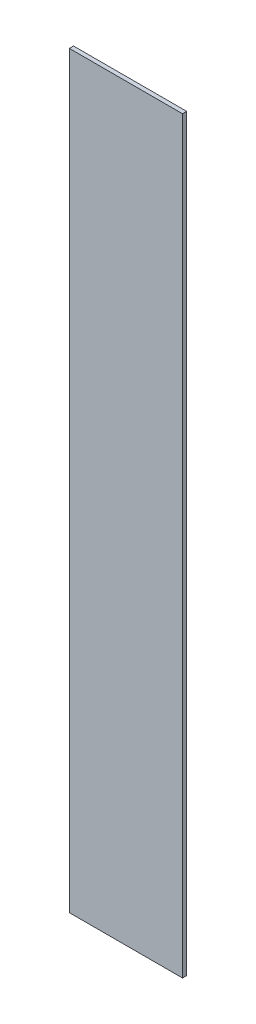
ISO-10303-21;
HEADER;
FILE_DESCRIPTION(('STEP AP214'),'2;1');
FILE_NAME('part.step','',(''),(''),'','','');
FILE_SCHEMA(('AUTOMOTIVE_DESIGN { 1 0 10303 214 1 1 1 1 }'));
ENDSEC;
DATA;
#1=APPLICATION_CONTEXT('core data for automotive mechanical design processes');
#2=APPLICATION_PROTOCOL_DEFINITION('international standard','automotive_design',2000,#1);
#3=PRODUCT_CONTEXT('',#1,'mechanical');
#4=PRODUCT('Part','Part','',(#3));
#5=PRODUCT_RELATED_PRODUCT_CATEGORY('part','',(#4));
#6=PRODUCT_DEFINITION_FORMATION('','',#4);
#7=PRODUCT_DEFINITION_CONTEXT('part definition',#1,'design');
#8=PRODUCT_DEFINITION('design','',#6,#7);
#9=PRODUCT_DEFINITION_SHAPE('','',#8);
#10=(LENGTH_UNIT() NAMED_UNIT(*) SI_UNIT(.MILLI.,.METRE.));
#11=(NAMED_UNIT(*) PLANE_ANGLE_UNIT() SI_UNIT($,.RADIAN.));
#12=(NAMED_UNIT(*) SI_UNIT($,.STERADIAN.) SOLID_ANGLE_UNIT());
#13=UNCERTAINTY_MEASURE_WITH_UNIT(LENGTH_MEASURE(1.E-05),#10,'distance_accuracy_value','');
#14=(GEOMETRIC_REPRESENTATION_CONTEXT(3) GLOBAL_UNCERTAINTY_ASSIGNED_CONTEXT((#13)) GLOBAL_UNIT_ASSIGNED_CONTEXT((#10,
#11,#12)) REPRESENTATION_CONTEXT('',''));
#15=CARTESIAN_POINT('',(0.,0.,0.));
#16=DIRECTION('',(0.,0.,1.));
#17=DIRECTION('',(1.,0.,0.));
#18=AXIS2_PLACEMENT_3D('',#15,#16,#17);
#19=CARTESIAN_POINT('',(0.,0.,3.175));
#20=DIRECTION('',(1.,0.,0.));
#21=DIRECTION('',(0.,0.,-1.));
#22=AXIS2_PLACEMENT_3D('',#19,#20,#21);
#23=PLANE('',#22);
#24=DIRECTION('',(0.,-1.,0.));
#25=VECTOR('',#24,1.);
#26=CARTESIAN_POINT('',(0.,0.,0.));
#27=LINE('',#26,#25);
#28=CARTESIAN_POINT('',(0.,571.5,0.));
#29=VERTEX_POINT('',#28);
#30=CARTESIAN_POINT('',(0.,0.,0.));
#31=VERTEX_POINT('',#30);
#32=EDGE_CURVE('E111',#29,#31,#27,.T.);
#33=ORIENTED_EDGE('',*,*,#32,.T.);
#34=DIRECTION('',(0.,0.,-1.));
#35=VECTOR('',#34,1.);
#36=CARTESIAN_POINT('',(0.,0.,3.175));
#37=LINE('',#36,#35);
#38=CARTESIAN_POINT('',(0.,0.,3.175));
#39=VERTEX_POINT('',#38);
#40=EDGE_CURVE('E11',#39,#31,#37,.T.);
#41=ORIENTED_EDGE('',*,*,#40,.F.);
#42=DIRECTION('',(0.,-1.,0.));
#43=VECTOR('',#42,1.);
#44=CARTESIAN_POINT('',(0.,0.,3.175));
#45=LINE('',#44,#43);
#46=CARTESIAN_POINT('',(0.,571.5,3.175));
#47=VERTEX_POINT('',#46);
#48=EDGE_CURVE('E95',#47,#39,#45,.T.);
#49=ORIENTED_EDGE('',*,*,#48,.F.);
#50=DIRECTION('',(0.,0.,-1.));
#51=VECTOR('',#50,1.);
#52=CARTESIAN_POINT('',(0.,571.5,3.175));
#53=LINE('',#52,#51);
#54=EDGE_CURVE('E107',#47,#29,#53,.T.);
#55=ORIENTED_EDGE('',*,*,#54,.T.);
#56=EDGE_LOOP('',(#33,#41,#49,#55));
#57=FACE_BOUND('',#56,.T.);
#58=ADVANCED_FACE('F43',(#57),#23,.F.);
#59=CARTESIAN_POINT('',(0.,0.,3.175));
#60=DIRECTION('',(0.,1.,0.));
#61=DIRECTION('',(0.,0.,1.));
#62=AXIS2_PLACEMENT_3D('',#59,#60,#61);
#63=PLANE('',#62);
#64=DIRECTION('',(1.,0.,0.));
#65=VECTOR('',#64,1.);
#66=CARTESIAN_POINT('',(0.,0.,0.));
#67=LINE('',#66,#65);
#68=CARTESIAN_POINT('',(86.36,0.,0.));
#69=VERTEX_POINT('',#68);
#70=EDGE_CURVE('E100',#31,#69,#67,.T.);
#71=ORIENTED_EDGE('',*,*,#70,.T.);
#72=DIRECTION('',(0.,0.,-1.));
#73=VECTOR('',#72,1.);
#74=CARTESIAN_POINT('',(86.36,0.,3.175));
#75=LINE('',#74,#73);
#76=CARTESIAN_POINT('',(86.36,0.,3.175));
#77=VERTEX_POINT('',#76);
#78=EDGE_CURVE('E52',#77,#69,#75,.T.);
#79=ORIENTED_EDGE('',*,*,#78,.F.);
#80=DIRECTION('',(1.,0.,0.));
#81=VECTOR('',#80,1.);
#82=CARTESIAN_POINT('',(0.,0.,3.175));
#83=LINE('',#82,#81);
#84=EDGE_CURVE('E90',#39,#77,#83,.T.);
#85=ORIENTED_EDGE('',*,*,#84,.F.);
#86=ORIENTED_EDGE('',*,*,#40,.T.);
#87=EDGE_LOOP('',(#71,#79,#85,#86));
#88=FACE_BOUND('',#87,.T.);
#89=ADVANCED_FACE('F99',(#88),#63,.F.);
#90=CARTESIAN_POINT('',(86.36,0.,3.175));
#91=DIRECTION('',(-1.,0.,0.));
#92=DIRECTION('',(0.,0.,1.));
#93=AXIS2_PLACEMENT_3D('',#90,#91,#92);
#94=PLANE('',#93);
#95=DIRECTION('',(0.,1.,0.));
#96=VECTOR('',#95,1.);
#97=CARTESIAN_POINT('',(86.36,0.,0.));
#98=LINE('',#97,#96);
#99=CARTESIAN_POINT('',(86.36,571.5,0.));
#100=VERTEX_POINT('',#99);
#101=EDGE_CURVE('E77',#69,#100,#98,.T.);
#102=ORIENTED_EDGE('',*,*,#101,.T.);
#103=DIRECTION('',(0.,0.,-1.));
#104=VECTOR('',#103,1.);
#105=CARTESIAN_POINT('',(86.36,571.5,3.175));
#106=LINE('',#105,#104);
#107=CARTESIAN_POINT('',(86.36,571.5,3.175));
#108=VERTEX_POINT('',#107);
#109=EDGE_CURVE('E102',#108,#100,#106,.T.);
#110=ORIENTED_EDGE('',*,*,#109,.F.);
#111=DIRECTION('',(0.,1.,0.));
#112=VECTOR('',#111,1.);
#113=CARTESIAN_POINT('',(86.36,0.,3.175));
#114=LINE('',#113,#112);
#115=EDGE_CURVE('E93',#77,#108,#114,.T.);
#116=ORIENTED_EDGE('',*,*,#115,.F.);
#117=ORIENTED_EDGE('',*,*,#78,.T.);
#118=EDGE_LOOP('',(#102,#110,#116,#117));
#119=FACE_BOUND('',#118,.T.);
#120=ADVANCED_FACE('F103',(#119),#94,.F.);
#121=CARTESIAN_POINT('',(0.,571.5,3.175));
#122=DIRECTION('',(0.,-1.,0.));
#123=DIRECTION('',(0.,0.,-1.));
#124=AXIS2_PLACEMENT_3D('',#121,#122,#123);
#125=PLANE('',#124);
#126=DIRECTION('',(-1.,0.,0.));
#127=VECTOR('',#126,1.);
#128=CARTESIAN_POINT('',(0.,571.5,0.));
#129=LINE('',#128,#127);
#130=EDGE_CURVE('E83',#100,#29,#129,.T.);
#131=ORIENTED_EDGE('',*,*,#130,.T.);
#132=ORIENTED_EDGE('',*,*,#54,.F.);
#133=DIRECTION('',(-1.,0.,0.));
#134=VECTOR('',#133,1.);
#135=CARTESIAN_POINT('',(0.,571.5,3.175));
#136=LINE('',#135,#134);
#137=EDGE_CURVE('E60',#108,#47,#136,.T.);
#138=ORIENTED_EDGE('',*,*,#137,.F.);
#139=ORIENTED_EDGE('',*,*,#109,.T.);
#140=EDGE_LOOP('',(#131,#132,#138,#139));
#141=FACE_BOUND('',#140,.T.);
#142=ADVANCED_FACE('F124',(#141),#125,.F.);
#143=CARTESIAN_POINT('',(0.,0.,3.175));
#144=DIRECTION('',(0.,0.,-1.));
#145=DIRECTION('',(-1.,0.,0.));
#146=AXIS2_PLACEMENT_3D('',#143,#144,#145);
#147=PLANE('',#146);
#148=ORIENTED_EDGE('',*,*,#48,.T.);
#149=ORIENTED_EDGE('',*,*,#84,.T.);
#150=ORIENTED_EDGE('',*,*,#115,.T.);
#151=ORIENTED_EDGE('',*,*,#137,.T.);
#152=EDGE_LOOP('',(#148,#149,#150,#151));
#153=FACE_BOUND('',#152,.T.);
#154=ADVANCED_FACE('F91',(#153),#147,.F.);
#155=CARTESIAN_POINT('',(0.,0.,0.));
#156=DIRECTION('',(0.,0.,-1.));
#157=DIRECTION('',(-1.,0.,0.));
#158=AXIS2_PLACEMENT_3D('',#155,#156,#157);
#159=PLANE('',#158);
#160=ORIENTED_EDGE('',*,*,#32,.F.);
#161=ORIENTED_EDGE('',*,*,#130,.F.);
#162=ORIENTED_EDGE('',*,*,#101,.F.);
#163=ORIENTED_EDGE('',*,*,#70,.F.);
#164=EDGE_LOOP('',(#160,#161,#162,#163));
#165=FACE_BOUND('',#164,.T.);
#166=ADVANCED_FACE('F127',(#165),#159,.T.);
#167=CLOSED_SHELL('',(#58,#89,#120,#142,#154,#166));
#168=MANIFOLD_SOLID_BREP('B2',#167);
#169=ADVANCED_BREP_SHAPE_REPRESENTATION('',(#18,#168),#14);
#170=SHAPE_DEFINITION_REPRESENTATION(#9,#169);
ENDSEC;
END-ISO-10303-21;
